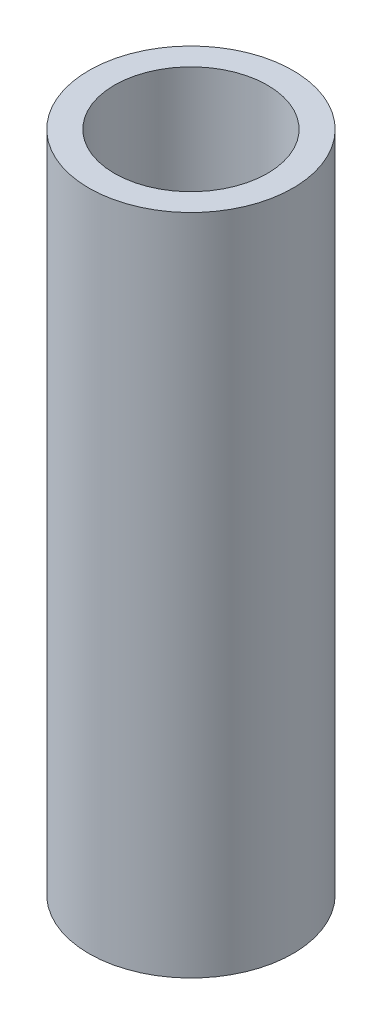
ISO-10303-21;
HEADER;
FILE_DESCRIPTION(('STEP AP214'),'2;1');
FILE_NAME('part.step','',(''),(''),'','','');
FILE_SCHEMA(('AUTOMOTIVE_DESIGN { 1 0 10303 214 1 1 1 1 }'));
ENDSEC;
DATA;
#1=APPLICATION_CONTEXT('core data for automotive mechanical design processes');
#2=APPLICATION_PROTOCOL_DEFINITION('international standard','automotive_design',2000,#1);
#3=PRODUCT_CONTEXT('',#1,'mechanical');
#4=PRODUCT('Part','Part','',(#3));
#5=PRODUCT_RELATED_PRODUCT_CATEGORY('part','',(#4));
#6=PRODUCT_DEFINITION_FORMATION('','',#4);
#7=PRODUCT_DEFINITION_CONTEXT('part definition',#1,'design');
#8=PRODUCT_DEFINITION('design','',#6,#7);
#9=PRODUCT_DEFINITION_SHAPE('','',#8);
#10=(LENGTH_UNIT() NAMED_UNIT(*) SI_UNIT(.MILLI.,.METRE.));
#11=(NAMED_UNIT(*) PLANE_ANGLE_UNIT() SI_UNIT($,.RADIAN.));
#12=(NAMED_UNIT(*) SI_UNIT($,.STERADIAN.) SOLID_ANGLE_UNIT());
#13=UNCERTAINTY_MEASURE_WITH_UNIT(LENGTH_MEASURE(1.E-05),#10,'distance_accuracy_value','');
#14=(GEOMETRIC_REPRESENTATION_CONTEXT(3) GLOBAL_UNCERTAINTY_ASSIGNED_CONTEXT((#13)) GLOBAL_UNIT_ASSIGNED_CONTEXT((#10,
#11,#12)) REPRESENTATION_CONTEXT('',''));
#15=CARTESIAN_POINT('',(0.,0.,0.));
#16=DIRECTION('',(0.,0.,1.));
#17=DIRECTION('',(1.,0.,0.));
#18=AXIS2_PLACEMENT_3D('',#15,#16,#17);
#19=CARTESIAN_POINT('',(0.,26.,0.));
#20=DIRECTION('',(0.,1.,0.));
#21=DIRECTION('',(0.,0.,1.));
#22=AXIS2_PLACEMENT_3D('',#19,#20,#21);
#23=PLANE('',#22);
#24=CARTESIAN_POINT('',(0.,26.,0.));
#25=DIRECTION('',(0.,1.,0.));
#26=DIRECTION('',(0.,0.,1.));
#27=AXIS2_PLACEMENT_3D('',#24,#25,#26);
#28=CIRCLE('',#27,4.);
#29=CARTESIAN_POINT('',(0.,26.,4.));
#30=VERTEX_POINT('',#29);
#31=EDGE_CURVE('E10',#30,#30,#28,.T.);
#32=ORIENTED_EDGE('',*,*,#31,.T.);
#33=EDGE_LOOP('',(#32));
#34=FACE_BOUND('',#33,.T.);
#35=CARTESIAN_POINT('',(0.,26.,0.));
#36=DIRECTION('',(0.,1.,0.));
#37=DIRECTION('',(0.,0.,1.));
#38=AXIS2_PLACEMENT_3D('',#35,#36,#37);
#39=CIRCLE('',#38,3.);
#40=CARTESIAN_POINT('',(0.,26.,3.));
#41=VERTEX_POINT('',#40);
#42=EDGE_CURVE('E42',#41,#41,#39,.T.);
#43=ORIENTED_EDGE('',*,*,#42,.F.);
#44=EDGE_LOOP('',(#43));
#45=FACE_BOUND('',#44,.T.);
#46=ADVANCED_FACE('F31',(#34,#45),#23,.T.);
#47=CARTESIAN_POINT('',(0.,0.,0.));
#48=DIRECTION('',(0.,1.,0.));
#49=DIRECTION('',(0.,0.,1.));
#50=AXIS2_PLACEMENT_3D('',#47,#48,#49);
#51=PLANE('',#50);
#52=CARTESIAN_POINT('',(0.,0.,0.));
#53=DIRECTION('',(0.,1.,0.));
#54=DIRECTION('',(0.,0.,1.));
#55=AXIS2_PLACEMENT_3D('',#52,#53,#54);
#56=CIRCLE('',#55,4.);
#57=CARTESIAN_POINT('',(0.,0.,4.));
#58=VERTEX_POINT('',#57);
#59=EDGE_CURVE('E35',#58,#58,#56,.T.);
#60=ORIENTED_EDGE('',*,*,#59,.F.);
#61=EDGE_LOOP('',(#60));
#62=FACE_BOUND('',#61,.T.);
#63=CARTESIAN_POINT('',(0.,0.,0.));
#64=DIRECTION('',(0.,1.,0.));
#65=DIRECTION('',(0.,0.,1.));
#66=AXIS2_PLACEMENT_3D('',#63,#64,#65);
#67=CIRCLE('',#66,3.);
#68=CARTESIAN_POINT('',(0.,0.,3.));
#69=VERTEX_POINT('',#68);
#70=EDGE_CURVE('E44',#69,#69,#67,.T.);
#71=ORIENTED_EDGE('',*,*,#70,.T.);
#72=EDGE_LOOP('',(#71));
#73=FACE_BOUND('',#72,.T.);
#74=ADVANCED_FACE('F54',(#62,#73),#51,.F.);
#75=CARTESIAN_POINT('',(0.,26.,0.));
#76=DIRECTION('',(0.,-1.,0.));
#77=DIRECTION('',(0.,0.,-1.));
#78=AXIS2_PLACEMENT_3D('',#75,#76,#77);
#79=CYLINDRICAL_SURFACE('',#78,4.);
#80=ORIENTED_EDGE('',*,*,#31,.F.);
#81=EDGE_LOOP('',(#80));
#82=FACE_BOUND('',#81,.T.);
#83=ORIENTED_EDGE('',*,*,#59,.T.);
#84=EDGE_LOOP('',(#83));
#85=FACE_BOUND('',#84,.T.);
#86=ADVANCED_FACE('F33',(#82,#85),#79,.T.);
#87=CARTESIAN_POINT('',(0.,26.,0.));
#88=DIRECTION('',(0.,-1.,0.));
#89=DIRECTION('',(0.,0.,-1.));
#90=AXIS2_PLACEMENT_3D('',#87,#88,#89);
#91=CYLINDRICAL_SURFACE('',#90,3.);
#92=ORIENTED_EDGE('',*,*,#42,.T.);
#93=EDGE_LOOP('',(#92));
#94=FACE_BOUND('',#93,.T.);
#95=ORIENTED_EDGE('',*,*,#70,.F.);
#96=EDGE_LOOP('',(#95));
#97=FACE_BOUND('',#96,.T.);
#98=ADVANCED_FACE('F50',(#94,#97),#91,.F.);
#99=CLOSED_SHELL('',(#46,#74,#86,#98));
#100=MANIFOLD_SOLID_BREP('B2',#99);
#101=ADVANCED_BREP_SHAPE_REPRESENTATION('',(#18,#100),#14);
#102=SHAPE_DEFINITION_REPRESENTATION(#9,#101);
ENDSEC;
END-ISO-10303-21;
